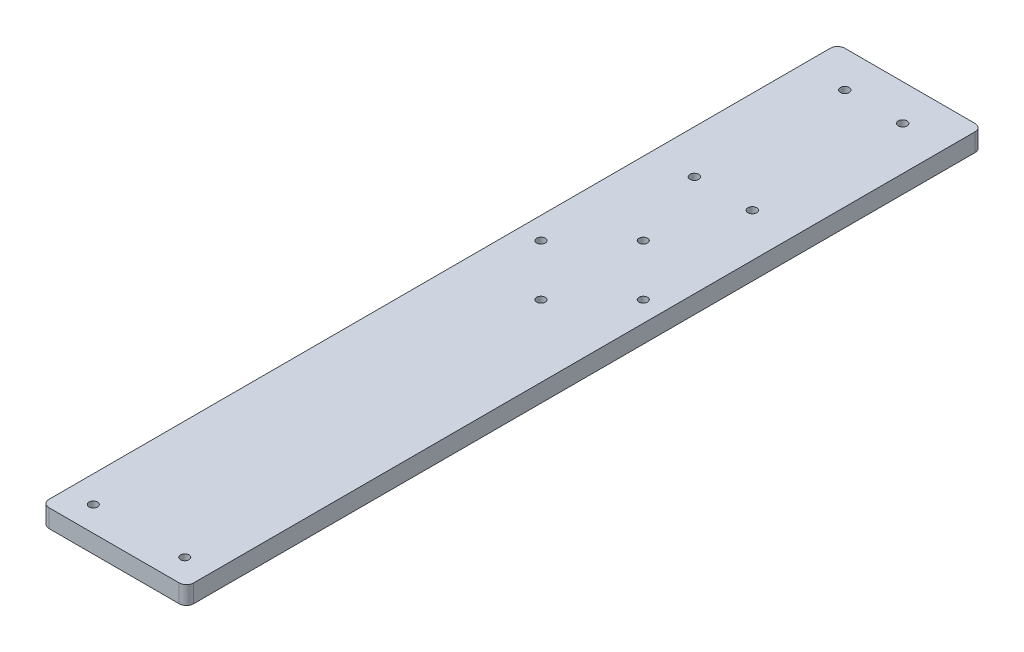
ISO-10303-21;
HEADER;
FILE_DESCRIPTION(('STEP AP214'),'2;1');
FILE_NAME('part.step','',(''),(''),'','','');
FILE_SCHEMA(('AUTOMOTIVE_DESIGN { 1 0 10303 214 1 1 1 1 }'));
ENDSEC;
DATA;
#1=APPLICATION_CONTEXT('core data for automotive mechanical design processes');
#2=APPLICATION_PROTOCOL_DEFINITION('international standard','automotive_design',2000,#1);
#3=PRODUCT_CONTEXT('',#1,'mechanical');
#4=PRODUCT('Part','Part','',(#3));
#5=PRODUCT_RELATED_PRODUCT_CATEGORY('part','',(#4));
#6=PRODUCT_DEFINITION_FORMATION('','',#4);
#7=PRODUCT_DEFINITION_CONTEXT('part definition',#1,'design');
#8=PRODUCT_DEFINITION('design','',#6,#7);
#9=PRODUCT_DEFINITION_SHAPE('','',#8);
#10=(LENGTH_UNIT() NAMED_UNIT(*) SI_UNIT(.MILLI.,.METRE.));
#11=(NAMED_UNIT(*) PLANE_ANGLE_UNIT() SI_UNIT($,.RADIAN.));
#12=(NAMED_UNIT(*) SI_UNIT($,.STERADIAN.) SOLID_ANGLE_UNIT());
#13=UNCERTAINTY_MEASURE_WITH_UNIT(LENGTH_MEASURE(1.E-05),#10,'distance_accuracy_value','');
#14=(GEOMETRIC_REPRESENTATION_CONTEXT(3) GLOBAL_UNCERTAINTY_ASSIGNED_CONTEXT((#13)) GLOBAL_UNIT_ASSIGNED_CONTEXT((#10,
#11,#12)) REPRESENTATION_CONTEXT('',''));
#15=CARTESIAN_POINT('',(0.,0.,0.));
#16=DIRECTION('',(0.,0.,1.));
#17=DIRECTION('',(1.,0.,0.));
#18=AXIS2_PLACEMENT_3D('',#15,#16,#17);
#19=CARTESIAN_POINT('',(2.54,6.35,-2.54));
#20=DIRECTION('',(0.,-1.,0.));
#21=DIRECTION('',(0.,0.,-1.));
#22=AXIS2_PLACEMENT_3D('',#19,#20,#21);
#23=CYLINDRICAL_SURFACE('',#22,2.54);
#24=CARTESIAN_POINT('',(2.54,0.,-2.54));
#25=DIRECTION('',(0.,1.,0.));
#26=DIRECTION('',(0.,0.,-1.));
#27=AXIS2_PLACEMENT_3D('',#24,#25,#26);
#28=CIRCLE('',#27,2.54);
#29=CARTESIAN_POINT('',(0.,0.,-2.54000000000002));
#30=VERTEX_POINT('',#29);
#31=CARTESIAN_POINT('',(2.54000000000002,0.,0.));
#32=VERTEX_POINT('',#31);
#33=EDGE_CURVE('E137',#30,#32,#28,.T.);
#34=ORIENTED_EDGE('',*,*,#33,.T.);
#35=DIRECTION('',(0.,-1.,0.));
#36=VECTOR('',#35,1.);
#37=CARTESIAN_POINT('',(2.54000000000002,6.35,0.));
#38=LINE('',#37,#36);
#39=CARTESIAN_POINT('',(2.54000000000002,6.35,0.));
#40=VERTEX_POINT('',#39);
#41=EDGE_CURVE('E11',#40,#32,#38,.T.);
#42=ORIENTED_EDGE('',*,*,#41,.F.);
#43=CARTESIAN_POINT('',(2.54,6.35,-2.54));
#44=DIRECTION('',(0.,1.,0.));
#45=DIRECTION('',(0.,0.,-1.));
#46=AXIS2_PLACEMENT_3D('',#43,#44,#45);
#47=CIRCLE('',#46,2.54);
#48=CARTESIAN_POINT('',(0.,6.35,-2.54000000000002));
#49=VERTEX_POINT('',#48);
#50=EDGE_CURVE('E159',#49,#40,#47,.T.);
#51=ORIENTED_EDGE('',*,*,#50,.F.);
#52=DIRECTION('',(0.,-1.,0.));
#53=VECTOR('',#52,1.);
#54=CARTESIAN_POINT('',(0.,6.35,-2.54000000000002));
#55=LINE('',#54,#53);
#56=EDGE_CURVE('E133',#49,#30,#55,.T.);
#57=ORIENTED_EDGE('',*,*,#56,.T.);
#58=EDGE_LOOP('',(#34,#42,#51,#57));
#59=FACE_BOUND('',#58,.T.);
#60=ADVANCED_FACE('F34',(#59),#23,.T.);
#61=CARTESIAN_POINT('',(2.54000000000002,6.35,0.));
#62=DIRECTION('',(0.,0.,-1.));
#63=DIRECTION('',(-1.,0.,0.));
#64=AXIS2_PLACEMENT_3D('',#61,#62,#63);
#65=PLANE('',#64);
#66=DIRECTION('',(1.,0.,0.));
#67=VECTOR('',#66,1.);
#68=CARTESIAN_POINT('',(2.54000000000002,0.,0.));
#69=LINE('',#68,#67);
#70=CARTESIAN_POINT('',(48.26,0.,0.));
#71=VERTEX_POINT('',#70);
#72=EDGE_CURVE('E141',#32,#71,#69,.T.);
#73=ORIENTED_EDGE('',*,*,#72,.T.);
#74=DIRECTION('',(0.,-1.,0.));
#75=VECTOR('',#74,1.);
#76=CARTESIAN_POINT('',(48.26,6.35,0.));
#77=LINE('',#76,#75);
#78=CARTESIAN_POINT('',(48.26,6.35,0.));
#79=VERTEX_POINT('',#78);
#80=EDGE_CURVE('E43',#79,#71,#77,.T.);
#81=ORIENTED_EDGE('',*,*,#80,.F.);
#82=DIRECTION('',(1.,0.,0.));
#83=VECTOR('',#82,1.);
#84=CARTESIAN_POINT('',(2.54000000000002,6.35,0.));
#85=LINE('',#84,#83);
#86=EDGE_CURVE('E94',#40,#79,#85,.T.);
#87=ORIENTED_EDGE('',*,*,#86,.F.);
#88=ORIENTED_EDGE('',*,*,#41,.T.);
#89=EDGE_LOOP('',(#73,#81,#87,#88));
#90=FACE_BOUND('',#89,.T.);
#91=ADVANCED_FACE('F326',(#90),#65,.F.);
#92=CARTESIAN_POINT('',(48.26,6.35,-2.54));
#93=DIRECTION('',(0.,-1.,0.));
#94=DIRECTION('',(0.,0.,-1.));
#95=AXIS2_PLACEMENT_3D('',#92,#93,#94);
#96=CYLINDRICAL_SURFACE('',#95,2.54);
#97=CARTESIAN_POINT('',(48.26,0.,-2.54));
#98=DIRECTION('',(0.,1.,0.));
#99=DIRECTION('',(0.,0.,1.));
#100=AXIS2_PLACEMENT_3D('',#97,#98,#99);
#101=CIRCLE('',#100,2.54);
#102=CARTESIAN_POINT('',(50.8,0.,-2.54000000000002));
#103=VERTEX_POINT('',#102);
#104=EDGE_CURVE('E145',#71,#103,#101,.T.);
#105=ORIENTED_EDGE('',*,*,#104,.T.);
#106=DIRECTION('',(0.,-1.,0.));
#107=VECTOR('',#106,1.);
#108=CARTESIAN_POINT('',(50.8,6.35,-2.54000000000002));
#109=LINE('',#108,#107);
#110=CARTESIAN_POINT('',(50.8,6.35,-2.54000000000002));
#111=VERTEX_POINT('',#110);
#112=EDGE_CURVE('E170',#111,#103,#109,.T.);
#113=ORIENTED_EDGE('',*,*,#112,.F.);
#114=CARTESIAN_POINT('',(48.26,6.35,-2.54));
#115=DIRECTION('',(0.,1.,0.));
#116=DIRECTION('',(0.,0.,1.));
#117=AXIS2_PLACEMENT_3D('',#114,#115,#116);
#118=CIRCLE('',#117,2.54);
#119=EDGE_CURVE('E182',#79,#111,#118,.T.);
#120=ORIENTED_EDGE('',*,*,#119,.F.);
#121=ORIENTED_EDGE('',*,*,#80,.T.);
#122=EDGE_LOOP('',(#105,#113,#120,#121));
#123=FACE_BOUND('',#122,.T.);
#124=ADVANCED_FACE('F180',(#123),#96,.T.);
#125=CARTESIAN_POINT('',(50.8,6.35,-2.54000000000002));
#126=DIRECTION('',(-1.,0.,0.));
#127=DIRECTION('',(0.,0.,1.));
#128=AXIS2_PLACEMENT_3D('',#125,#126,#127);
#129=PLANE('',#128);
#130=DIRECTION('',(0.,0.,-1.));
#131=VECTOR('',#130,1.);
#132=CARTESIAN_POINT('',(50.8,0.,-2.54000000000002));
#133=LINE('',#132,#131);
#134=CARTESIAN_POINT('',(50.8,0.,-276.86));
#135=VERTEX_POINT('',#134);
#136=EDGE_CURVE('E148',#103,#135,#133,.T.);
#137=ORIENTED_EDGE('',*,*,#136,.T.);
#138=DIRECTION('',(0.,-1.,0.));
#139=VECTOR('',#138,1.);
#140=CARTESIAN_POINT('',(50.8,6.35,-276.86));
#141=LINE('',#140,#139);
#142=CARTESIAN_POINT('',(50.8,6.35,-276.86));
#143=VERTEX_POINT('',#142);
#144=EDGE_CURVE('E166',#143,#135,#141,.T.);
#145=ORIENTED_EDGE('',*,*,#144,.F.);
#146=DIRECTION('',(0.,0.,-1.));
#147=VECTOR('',#146,1.);
#148=CARTESIAN_POINT('',(50.8,6.35,-2.54000000000002));
#149=LINE('',#148,#147);
#150=EDGE_CURVE('E195',#111,#143,#149,.T.);
#151=ORIENTED_EDGE('',*,*,#150,.F.);
#152=ORIENTED_EDGE('',*,*,#112,.T.);
#153=EDGE_LOOP('',(#137,#145,#151,#152));
#154=FACE_BOUND('',#153,.T.);
#155=ADVANCED_FACE('F190',(#154),#129,.F.);
#156=CARTESIAN_POINT('',(48.26,6.35,-276.86));
#157=DIRECTION('',(0.,-1.,0.));
#158=DIRECTION('',(0.,0.,-1.));
#159=AXIS2_PLACEMENT_3D('',#156,#157,#158);
#160=CYLINDRICAL_SURFACE('',#159,2.53999999999999);
#161=CARTESIAN_POINT('',(48.26,0.,-276.86));
#162=DIRECTION('',(0.,1.,0.));
#163=DIRECTION('',(0.,0.,-1.));
#164=AXIS2_PLACEMENT_3D('',#161,#162,#163);
#165=CIRCLE('',#164,2.53999999999999);
#166=CARTESIAN_POINT('',(48.26,0.,-279.4));
#167=VERTEX_POINT('',#166);
#168=EDGE_CURVE('E151',#135,#167,#165,.T.);
#169=ORIENTED_EDGE('',*,*,#168,.T.);
#170=DIRECTION('',(0.,-1.,0.));
#171=VECTOR('',#170,1.);
#172=CARTESIAN_POINT('',(48.26,6.35,-279.4));
#173=LINE('',#172,#171);
#174=CARTESIAN_POINT('',(48.26,6.35,-279.4));
#175=VERTEX_POINT('',#174);
#176=EDGE_CURVE('E124',#175,#167,#173,.T.);
#177=ORIENTED_EDGE('',*,*,#176,.F.);
#178=CARTESIAN_POINT('',(48.26,6.35,-276.86));
#179=DIRECTION('',(0.,1.,0.));
#180=DIRECTION('',(0.,0.,-1.));
#181=AXIS2_PLACEMENT_3D('',#178,#179,#180);
#182=CIRCLE('',#181,2.53999999999999);
#183=EDGE_CURVE('E113',#143,#175,#182,.T.);
#184=ORIENTED_EDGE('',*,*,#183,.F.);
#185=ORIENTED_EDGE('',*,*,#144,.T.);
#186=EDGE_LOOP('',(#169,#177,#184,#185));
#187=FACE_BOUND('',#186,.T.);
#188=ADVANCED_FACE('F193',(#187),#160,.T.);
#189=CARTESIAN_POINT('',(2.54,6.35,-279.4));
#190=DIRECTION('',(0.,0.,1.));
#191=DIRECTION('',(1.,0.,0.));
#192=AXIS2_PLACEMENT_3D('',#189,#190,#191);
#193=PLANE('',#192);
#194=DIRECTION('',(-1.,0.,0.));
#195=VECTOR('',#194,1.);
#196=CARTESIAN_POINT('',(2.54,0.,-279.4));
#197=LINE('',#196,#195);
#198=CARTESIAN_POINT('',(2.54,0.,-279.4));
#199=VERTEX_POINT('',#198);
#200=EDGE_CURVE('E122',#167,#199,#197,.T.);
#201=ORIENTED_EDGE('',*,*,#200,.T.);
#202=DIRECTION('',(0.,-1.,0.));
#203=VECTOR('',#202,1.);
#204=CARTESIAN_POINT('',(2.54,6.35,-279.4));
#205=LINE('',#204,#203);
#206=CARTESIAN_POINT('',(2.54,6.35,-279.4));
#207=VERTEX_POINT('',#206);
#208=EDGE_CURVE('E119',#207,#199,#205,.T.);
#209=ORIENTED_EDGE('',*,*,#208,.F.);
#210=DIRECTION('',(-1.,0.,0.));
#211=VECTOR('',#210,1.);
#212=CARTESIAN_POINT('',(2.54,6.35,-279.4));
#213=LINE('',#212,#211);
#214=EDGE_CURVE('E107',#175,#207,#213,.T.);
#215=ORIENTED_EDGE('',*,*,#214,.F.);
#216=ORIENTED_EDGE('',*,*,#176,.T.);
#217=EDGE_LOOP('',(#201,#209,#215,#216));
#218=FACE_BOUND('',#217,.T.);
#219=ADVANCED_FACE('F120',(#218),#193,.F.);
#220=CARTESIAN_POINT('',(2.54,6.35,-276.86));
#221=DIRECTION('',(0.,-1.,0.));
#222=DIRECTION('',(0.,0.,-1.));
#223=AXIS2_PLACEMENT_3D('',#220,#221,#222);
#224=CYLINDRICAL_SURFACE('',#223,2.53999999999999);
#225=CARTESIAN_POINT('',(2.54,0.,-276.86));
#226=DIRECTION('',(0.,1.,0.));
#227=DIRECTION('',(0.,0.,-1.));
#228=AXIS2_PLACEMENT_3D('',#225,#226,#227);
#229=CIRCLE('',#228,2.53999999999999);
#230=CARTESIAN_POINT('',(0.,0.,-276.86));
#231=VERTEX_POINT('',#230);
#232=EDGE_CURVE('E80',#199,#231,#229,.T.);
#233=ORIENTED_EDGE('',*,*,#232,.T.);
#234=DIRECTION('',(0.,-1.,0.));
#235=VECTOR('',#234,1.);
#236=CARTESIAN_POINT('',(0.,6.35,-276.86));
#237=LINE('',#236,#235);
#238=CARTESIAN_POINT('',(0.,6.35,-276.86));
#239=VERTEX_POINT('',#238);
#240=EDGE_CURVE('E125',#239,#231,#237,.T.);
#241=ORIENTED_EDGE('',*,*,#240,.F.);
#242=CARTESIAN_POINT('',(2.54,6.35,-276.86));
#243=DIRECTION('',(0.,1.,0.));
#244=DIRECTION('',(0.,0.,-1.));
#245=AXIS2_PLACEMENT_3D('',#242,#243,#244);
#246=CIRCLE('',#245,2.53999999999999);
#247=EDGE_CURVE('E111',#207,#239,#246,.T.);
#248=ORIENTED_EDGE('',*,*,#247,.F.);
#249=ORIENTED_EDGE('',*,*,#208,.T.);
#250=EDGE_LOOP('',(#233,#241,#248,#249));
#251=FACE_BOUND('',#250,.T.);
#252=ADVANCED_FACE('F127',(#251),#224,.T.);
#253=CARTESIAN_POINT('',(0.,6.35,-2.54000000000002));
#254=DIRECTION('',(1.,0.,0.));
#255=DIRECTION('',(0.,0.,-1.));
#256=AXIS2_PLACEMENT_3D('',#253,#254,#255);
#257=PLANE('',#256);
#258=DIRECTION('',(0.,0.,1.));
#259=VECTOR('',#258,1.);
#260=CARTESIAN_POINT('',(0.,0.,-2.54000000000002));
#261=LINE('',#260,#259);
#262=EDGE_CURVE('E86',#231,#30,#261,.T.);
#263=ORIENTED_EDGE('',*,*,#262,.T.);
#264=ORIENTED_EDGE('',*,*,#56,.F.);
#265=DIRECTION('',(0.,0.,1.));
#266=VECTOR('',#265,1.);
#267=CARTESIAN_POINT('',(0.,6.35,-2.54000000000002));
#268=LINE('',#267,#266);
#269=EDGE_CURVE('E51',#239,#49,#268,.T.);
#270=ORIENTED_EDGE('',*,*,#269,.F.);
#271=ORIENTED_EDGE('',*,*,#240,.T.);
#272=EDGE_LOOP('',(#263,#264,#270,#271));
#273=FACE_BOUND('',#272,.T.);
#274=ADVANCED_FACE('F333',(#273),#257,.F.);
#275=CARTESIAN_POINT('',(2.54,6.35,-2.54));
#276=DIRECTION('',(0.,-1.,0.));
#277=DIRECTION('',(0.,0.,-1.));
#278=AXIS2_PLACEMENT_3D('',#275,#276,#277);
#279=PLANE('',#278);
#280=CARTESIAN_POINT('',(35.56,6.35,-213.899999999999));
#281=DIRECTION('',(0.,-1.,0.));
#282=DIRECTION('',(0.,0.,-1.));
#283=AXIS2_PLACEMENT_3D('',#280,#281,#282);
#284=CIRCLE('',#283,1.54999999999999);
#285=CARTESIAN_POINT('',(35.56,6.35,-215.449999999999));
#286=VERTEX_POINT('',#285);
#287=EDGE_CURVE('E270',#286,#286,#284,.T.);
#288=ORIENTED_EDGE('',*,*,#287,.T.);
#289=EDGE_LOOP('',(#288));
#290=FACE_BOUND('',#289,.T.);
#291=CARTESIAN_POINT('',(15.24,6.35,-213.899999999999));
#292=DIRECTION('',(0.,-1.,0.));
#293=DIRECTION('',(0.,0.,-1.));
#294=AXIS2_PLACEMENT_3D('',#291,#292,#293);
#295=CIRCLE('',#294,1.55);
#296=CARTESIAN_POINT('',(15.24,6.35,-215.449999999999));
#297=VERTEX_POINT('',#296);
#298=EDGE_CURVE('E263',#297,#297,#295,.T.);
#299=ORIENTED_EDGE('',*,*,#298,.T.);
#300=EDGE_LOOP('',(#299));
#301=FACE_BOUND('',#300,.T.);
#302=CARTESIAN_POINT('',(35.56,6.35,-266.7));
#303=DIRECTION('',(0.,-1.,0.));
#304=DIRECTION('',(0.,0.,-1.));
#305=AXIS2_PLACEMENT_3D('',#302,#303,#304);
#306=CIRCLE('',#305,1.55000000000001);
#307=CARTESIAN_POINT('',(35.56,6.35,-268.25));
#308=VERTEX_POINT('',#307);
#309=EDGE_CURVE('E256',#308,#308,#306,.T.);
#310=ORIENTED_EDGE('',*,*,#309,.T.);
#311=EDGE_LOOP('',(#310));
#312=FACE_BOUND('',#311,.T.);
#313=CARTESIAN_POINT('',(15.24,6.35,-266.7));
#314=DIRECTION('',(0.,-1.,0.));
#315=DIRECTION('',(0.,0.,-1.));
#316=AXIS2_PLACEMENT_3D('',#313,#314,#315);
#317=CIRCLE('',#316,1.55000000000001);
#318=CARTESIAN_POINT('',(15.24,6.35,-268.25));
#319=VERTEX_POINT('',#318);
#320=EDGE_CURVE('E248',#319,#319,#317,.T.);
#321=ORIENTED_EDGE('',*,*,#320,.T.);
#322=EDGE_LOOP('',(#321));
#323=FACE_BOUND('',#322,.T.);
#324=CARTESIAN_POINT('',(9.34999999999999,6.35,-8.75848719394659));
#325=DIRECTION('',(0.,-1.,0.));
#326=DIRECTION('',(0.,0.,-1.));
#327=AXIS2_PLACEMENT_3D('',#324,#325,#326);
#328=CIRCLE('',#327,1.5);
#329=CARTESIAN_POINT('',(9.34999999999999,6.35,-10.2584871939466));
#330=VERTEX_POINT('',#329);
#331=EDGE_CURVE('E240',#330,#330,#328,.T.);
#332=ORIENTED_EDGE('',*,*,#331,.T.);
#333=EDGE_LOOP('',(#332));
#334=FACE_BOUND('',#333,.T.);
#335=CARTESIAN_POINT('',(41.45,6.35,-8.75848719394656));
#336=DIRECTION('',(0.,-1.,0.));
#337=DIRECTION('',(0.,0.,-1.));
#338=AXIS2_PLACEMENT_3D('',#335,#336,#337);
#339=CIRCLE('',#338,1.5);
#340=CARTESIAN_POINT('',(41.45,6.35,-10.2584871939466));
#341=VERTEX_POINT('',#340);
#342=EDGE_CURVE('E232',#341,#341,#339,.T.);
#343=ORIENTED_EDGE('',*,*,#342,.T.);
#344=EDGE_LOOP('',(#343));
#345=FACE_BOUND('',#344,.T.);
#346=CARTESIAN_POINT('',(25.6620879768943,6.35,-149.60397551572));
#347=DIRECTION('',(0.,-1.,0.));
#348=DIRECTION('',(0.,0.,-1.));
#349=AXIS2_PLACEMENT_3D('',#346,#347,#348);
#350=CIRCLE('',#349,1.5);
#351=CARTESIAN_POINT('',(25.6620879768943,6.35,-151.10397551572));
#352=VERTEX_POINT('',#351);
#353=EDGE_CURVE('E224',#352,#352,#350,.T.);
#354=ORIENTED_EDGE('',*,*,#353,.T.);
#355=EDGE_LOOP('',(#354));
#356=FACE_BOUND('',#355,.T.);
#357=CARTESIAN_POINT('',(7.70157573475598,6.35,-167.564487757859));
#358=DIRECTION('',(0.,-1.,0.));
#359=DIRECTION('',(0.,0.,-1.));
#360=AXIS2_PLACEMENT_3D('',#357,#358,#359);
#361=CIRCLE('',#360,1.5);
#362=CARTESIAN_POINT('',(7.70157573475598,6.35,-169.064487757859));
#363=VERTEX_POINT('',#362);
#364=EDGE_CURVE('E217',#363,#363,#361,.T.);
#365=ORIENTED_EDGE('',*,*,#364,.T.);
#366=EDGE_LOOP('',(#365));
#367=FACE_BOUND('',#366,.T.);
#368=CARTESIAN_POINT('',(43.6226002190326,6.35,-167.564487757859));
#369=DIRECTION('',(0.,-1.,0.));
#370=DIRECTION('',(0.,0.,-1.));
#371=AXIS2_PLACEMENT_3D('',#368,#369,#370);
#372=CIRCLE('',#371,1.5);
#373=CARTESIAN_POINT('',(43.6226002190326,6.35,-169.064487757859));
#374=VERTEX_POINT('',#373);
#375=EDGE_CURVE('E209',#374,#374,#372,.T.);
#376=ORIENTED_EDGE('',*,*,#375,.T.);
#377=EDGE_LOOP('',(#376));
#378=FACE_BOUND('',#377,.T.);
#379=CARTESIAN_POINT('',(25.6620879768943,6.35,-185.524999999997));
#380=DIRECTION('',(0.,-1.,0.));
#381=DIRECTION('',(0.,0.,-1.));
#382=AXIS2_PLACEMENT_3D('',#379,#380,#381);
#383=CIRCLE('',#382,1.5);
#384=CARTESIAN_POINT('',(25.6620879768943,6.35,-187.024999999997));
#385=VERTEX_POINT('',#384);
#386=EDGE_CURVE('E142',#385,#385,#383,.T.);
#387=ORIENTED_EDGE('',*,*,#386,.T.);
#388=EDGE_LOOP('',(#387));
#389=FACE_BOUND('',#388,.T.);
#390=ORIENTED_EDGE('',*,*,#50,.T.);
#391=ORIENTED_EDGE('',*,*,#86,.T.);
#392=ORIENTED_EDGE('',*,*,#119,.T.);
#393=ORIENTED_EDGE('',*,*,#150,.T.);
#394=ORIENTED_EDGE('',*,*,#183,.T.);
#395=ORIENTED_EDGE('',*,*,#214,.T.);
#396=ORIENTED_EDGE('',*,*,#247,.T.);
#397=ORIENTED_EDGE('',*,*,#269,.T.);
#398=EDGE_LOOP('',(#390,#391,#392,#393,#394,#395,#396,#397));
#399=FACE_BOUND('',#398,.T.);
#400=ADVANCED_FACE('F109',(#290,#301,#312,#323,#334,#345,#356,#367,#378,#389,#399),#279,.F.);
#401=CARTESIAN_POINT('',(2.54,0.,-2.54));
#402=DIRECTION('',(0.,-1.,0.));
#403=DIRECTION('',(0.,0.,-1.));
#404=AXIS2_PLACEMENT_3D('',#401,#402,#403);
#405=PLANE('',#404);
#406=CARTESIAN_POINT('',(35.56,0.,-213.899999999999));
#407=DIRECTION('',(0.,-1.,0.));
#408=DIRECTION('',(0.,0.,-1.));
#409=AXIS2_PLACEMENT_3D('',#406,#407,#408);
#410=CIRCLE('',#409,1.54999999999999);
#411=CARTESIAN_POINT('',(35.56,0.,-215.449999999999));
#412=VERTEX_POINT('',#411);
#413=EDGE_CURVE('E274',#412,#412,#410,.T.);
#414=ORIENTED_EDGE('',*,*,#413,.F.);
#415=EDGE_LOOP('',(#414));
#416=FACE_BOUND('',#415,.T.);
#417=CARTESIAN_POINT('',(15.24,0.,-213.899999999999));
#418=DIRECTION('',(0.,-1.,0.));
#419=DIRECTION('',(0.,0.,-1.));
#420=AXIS2_PLACEMENT_3D('',#417,#418,#419);
#421=CIRCLE('',#420,1.55);
#422=CARTESIAN_POINT('',(15.24,0.,-215.449999999999));
#423=VERTEX_POINT('',#422);
#424=EDGE_CURVE('E266',#423,#423,#421,.T.);
#425=ORIENTED_EDGE('',*,*,#424,.F.);
#426=EDGE_LOOP('',(#425));
#427=FACE_BOUND('',#426,.T.);
#428=CARTESIAN_POINT('',(35.56,0.,-266.7));
#429=DIRECTION('',(0.,-1.,0.));
#430=DIRECTION('',(0.,0.,-1.));
#431=AXIS2_PLACEMENT_3D('',#428,#429,#430);
#432=CIRCLE('',#431,1.55000000000001);
#433=CARTESIAN_POINT('',(35.56,0.,-268.25));
#434=VERTEX_POINT('',#433);
#435=EDGE_CURVE('E260',#434,#434,#432,.T.);
#436=ORIENTED_EDGE('',*,*,#435,.F.);
#437=EDGE_LOOP('',(#436));
#438=FACE_BOUND('',#437,.T.);
#439=CARTESIAN_POINT('',(15.24,0.,-266.7));
#440=DIRECTION('',(0.,-1.,0.));
#441=DIRECTION('',(0.,0.,-1.));
#442=AXIS2_PLACEMENT_3D('',#439,#440,#441);
#443=CIRCLE('',#442,1.55000000000001);
#444=CARTESIAN_POINT('',(15.24,0.,-268.25));
#445=VERTEX_POINT('',#444);
#446=EDGE_CURVE('E252',#445,#445,#443,.T.);
#447=ORIENTED_EDGE('',*,*,#446,.F.);
#448=EDGE_LOOP('',(#447));
#449=FACE_BOUND('',#448,.T.);
#450=CARTESIAN_POINT('',(9.34999999999999,0.,-8.75848719394659));
#451=DIRECTION('',(0.,-1.,0.));
#452=DIRECTION('',(0.,0.,-1.));
#453=AXIS2_PLACEMENT_3D('',#450,#451,#452);
#454=CIRCLE('',#453,1.5);
#455=CARTESIAN_POINT('',(9.34999999999999,0.,-10.2584871939466));
#456=VERTEX_POINT('',#455);
#457=EDGE_CURVE('E244',#456,#456,#454,.T.);
#458=ORIENTED_EDGE('',*,*,#457,.F.);
#459=EDGE_LOOP('',(#458));
#460=FACE_BOUND('',#459,.T.);
#461=CARTESIAN_POINT('',(41.45,0.,-8.75848719394656));
#462=DIRECTION('',(0.,-1.,0.));
#463=DIRECTION('',(0.,0.,-1.));
#464=AXIS2_PLACEMENT_3D('',#461,#462,#463);
#465=CIRCLE('',#464,1.5);
#466=CARTESIAN_POINT('',(41.45,0.,-10.2584871939466));
#467=VERTEX_POINT('',#466);
#468=EDGE_CURVE('E236',#467,#467,#465,.T.);
#469=ORIENTED_EDGE('',*,*,#468,.F.);
#470=EDGE_LOOP('',(#469));
#471=FACE_BOUND('',#470,.T.);
#472=CARTESIAN_POINT('',(25.6620879768943,0.,-149.60397551572));
#473=DIRECTION('',(0.,-1.,0.));
#474=DIRECTION('',(0.,0.,-1.));
#475=AXIS2_PLACEMENT_3D('',#472,#473,#474);
#476=CIRCLE('',#475,1.5);
#477=CARTESIAN_POINT('',(25.6620879768943,0.,-151.10397551572));
#478=VERTEX_POINT('',#477);
#479=EDGE_CURVE('E228',#478,#478,#476,.T.);
#480=ORIENTED_EDGE('',*,*,#479,.F.);
#481=EDGE_LOOP('',(#480));
#482=FACE_BOUND('',#481,.T.);
#483=CARTESIAN_POINT('',(7.70157573475598,0.,-167.564487757859));
#484=DIRECTION('',(0.,-1.,0.));
#485=DIRECTION('',(0.,0.,-1.));
#486=AXIS2_PLACEMENT_3D('',#483,#484,#485);
#487=CIRCLE('',#486,1.5);
#488=CARTESIAN_POINT('',(7.70157573475598,0.,-169.064487757859));
#489=VERTEX_POINT('',#488);
#490=EDGE_CURVE('E221',#489,#489,#487,.T.);
#491=ORIENTED_EDGE('',*,*,#490,.F.);
#492=EDGE_LOOP('',(#491));
#493=FACE_BOUND('',#492,.T.);
#494=CARTESIAN_POINT('',(43.6226002190326,0.,-167.564487757859));
#495=DIRECTION('',(0.,-1.,0.));
#496=DIRECTION('',(0.,0.,-1.));
#497=AXIS2_PLACEMENT_3D('',#494,#495,#496);
#498=CIRCLE('',#497,1.5);
#499=CARTESIAN_POINT('',(43.6226002190326,0.,-169.064487757859));
#500=VERTEX_POINT('',#499);
#501=EDGE_CURVE('E213',#500,#500,#498,.T.);
#502=ORIENTED_EDGE('',*,*,#501,.F.);
#503=EDGE_LOOP('',(#502));
#504=FACE_BOUND('',#503,.T.);
#505=CARTESIAN_POINT('',(25.6620879768943,0.,-185.524999999997));
#506=DIRECTION('',(0.,-1.,0.));
#507=DIRECTION('',(0.,0.,-1.));
#508=AXIS2_PLACEMENT_3D('',#505,#506,#507);
#509=CIRCLE('',#508,1.5);
#510=CARTESIAN_POINT('',(25.6620879768943,0.,-187.024999999997));
#511=VERTEX_POINT('',#510);
#512=EDGE_CURVE('E205',#511,#511,#509,.T.);
#513=ORIENTED_EDGE('',*,*,#512,.F.);
#514=EDGE_LOOP('',(#513));
#515=FACE_BOUND('',#514,.T.);
#516=ORIENTED_EDGE('',*,*,#33,.F.);
#517=ORIENTED_EDGE('',*,*,#262,.F.);
#518=ORIENTED_EDGE('',*,*,#232,.F.);
#519=ORIENTED_EDGE('',*,*,#200,.F.);
#520=ORIENTED_EDGE('',*,*,#168,.F.);
#521=ORIENTED_EDGE('',*,*,#136,.F.);
#522=ORIENTED_EDGE('',*,*,#104,.F.);
#523=ORIENTED_EDGE('',*,*,#72,.F.);
#524=EDGE_LOOP('',(#516,#517,#518,#519,#520,#521,#522,#523));
#525=FACE_BOUND('',#524,.T.);
#526=ADVANCED_FACE('F186',(#416,#427,#438,#449,#460,#471,#482,#493,#504,#515,#525),#405,.T.);
#527=CARTESIAN_POINT('',(25.6620879768943,6.35,-185.524999999997));
#528=DIRECTION('',(0.,-1.,0.));
#529=DIRECTION('',(0.,0.,-1.));
#530=AXIS2_PLACEMENT_3D('',#527,#528,#529);
#531=CYLINDRICAL_SURFACE('',#530,1.5);
#532=ORIENTED_EDGE('',*,*,#386,.F.);
#533=EDGE_LOOP('',(#532));
#534=FACE_BOUND('',#533,.T.);
#535=ORIENTED_EDGE('',*,*,#512,.T.);
#536=EDGE_LOOP('',(#535));
#537=FACE_BOUND('',#536,.T.);
#538=ADVANCED_FACE('F293',(#534,#537),#531,.F.);
#539=CARTESIAN_POINT('',(43.6226002190326,6.35,-167.564487757859));
#540=DIRECTION('',(0.,-1.,0.));
#541=DIRECTION('',(0.,0.,-1.));
#542=AXIS2_PLACEMENT_3D('',#539,#540,#541);
#543=CYLINDRICAL_SURFACE('',#542,1.5);
#544=ORIENTED_EDGE('',*,*,#375,.F.);
#545=EDGE_LOOP('',(#544));
#546=FACE_BOUND('',#545,.T.);
#547=ORIENTED_EDGE('',*,*,#501,.T.);
#548=EDGE_LOOP('',(#547));
#549=FACE_BOUND('',#548,.T.);
#550=ADVANCED_FACE('F314',(#546,#549),#543,.F.);
#551=CARTESIAN_POINT('',(7.70157573475598,6.35,-167.564487757859));
#552=DIRECTION('',(0.,-1.,0.));
#553=DIRECTION('',(0.,0.,-1.));
#554=AXIS2_PLACEMENT_3D('',#551,#552,#553);
#555=CYLINDRICAL_SURFACE('',#554,1.5);
#556=ORIENTED_EDGE('',*,*,#364,.F.);
#557=EDGE_LOOP('',(#556));
#558=FACE_BOUND('',#557,.T.);
#559=ORIENTED_EDGE('',*,*,#490,.T.);
#560=EDGE_LOOP('',(#559));
#561=FACE_BOUND('',#560,.T.);
#562=ADVANCED_FACE('F320',(#558,#561),#555,.F.);
#563=CARTESIAN_POINT('',(25.6620879768943,6.35,-149.60397551572));
#564=DIRECTION('',(0.,-1.,0.));
#565=DIRECTION('',(0.,0.,-1.));
#566=AXIS2_PLACEMENT_3D('',#563,#564,#565);
#567=CYLINDRICAL_SURFACE('',#566,1.5);
#568=ORIENTED_EDGE('',*,*,#353,.F.);
#569=EDGE_LOOP('',(#568));
#570=FACE_BOUND('',#569,.T.);
#571=ORIENTED_EDGE('',*,*,#479,.T.);
#572=EDGE_LOOP('',(#571));
#573=FACE_BOUND('',#572,.T.);
#574=ADVANCED_FACE('F394',(#570,#573),#567,.F.);
#575=CARTESIAN_POINT('',(41.45,6.35,-8.75848719394656));
#576=DIRECTION('',(0.,-1.,0.));
#577=DIRECTION('',(0.,0.,-1.));
#578=AXIS2_PLACEMENT_3D('',#575,#576,#577);
#579=CYLINDRICAL_SURFACE('',#578,1.5);
#580=ORIENTED_EDGE('',*,*,#342,.F.);
#581=EDGE_LOOP('',(#580));
#582=FACE_BOUND('',#581,.T.);
#583=ORIENTED_EDGE('',*,*,#468,.T.);
#584=EDGE_LOOP('',(#583));
#585=FACE_BOUND('',#584,.T.);
#586=ADVANCED_FACE('F404',(#582,#585),#579,.F.);
#587=CARTESIAN_POINT('',(9.34999999999999,6.35,-8.75848719394659));
#588=DIRECTION('',(0.,-1.,0.));
#589=DIRECTION('',(0.,0.,-1.));
#590=AXIS2_PLACEMENT_3D('',#587,#588,#589);
#591=CYLINDRICAL_SURFACE('',#590,1.5);
#592=ORIENTED_EDGE('',*,*,#331,.F.);
#593=EDGE_LOOP('',(#592));
#594=FACE_BOUND('',#593,.T.);
#595=ORIENTED_EDGE('',*,*,#457,.T.);
#596=EDGE_LOOP('',(#595));
#597=FACE_BOUND('',#596,.T.);
#598=ADVANCED_FACE('F414',(#594,#597),#591,.F.);
#599=CARTESIAN_POINT('',(15.24,6.35,-266.7));
#600=DIRECTION('',(0.,-1.,0.));
#601=DIRECTION('',(0.,0.,-1.));
#602=AXIS2_PLACEMENT_3D('',#599,#600,#601);
#603=CYLINDRICAL_SURFACE('',#602,1.55000000000001);
#604=ORIENTED_EDGE('',*,*,#320,.F.);
#605=EDGE_LOOP('',(#604));
#606=FACE_BOUND('',#605,.T.);
#607=ORIENTED_EDGE('',*,*,#446,.T.);
#608=EDGE_LOOP('',(#607));
#609=FACE_BOUND('',#608,.T.);
#610=ADVANCED_FACE('F424',(#606,#609),#603,.F.);
#611=CARTESIAN_POINT('',(35.56,6.35,-266.7));
#612=DIRECTION('',(0.,-1.,0.));
#613=DIRECTION('',(0.,0.,-1.));
#614=AXIS2_PLACEMENT_3D('',#611,#612,#613);
#615=CYLINDRICAL_SURFACE('',#614,1.55000000000001);
#616=ORIENTED_EDGE('',*,*,#309,.F.);
#617=EDGE_LOOP('',(#616));
#618=FACE_BOUND('',#617,.T.);
#619=ORIENTED_EDGE('',*,*,#435,.T.);
#620=EDGE_LOOP('',(#619));
#621=FACE_BOUND('',#620,.T.);
#622=ADVANCED_FACE('F444',(#618,#621),#615,.F.);
#623=CARTESIAN_POINT('',(15.24,6.35,-213.899999999999));
#624=DIRECTION('',(0.,-1.,0.));
#625=DIRECTION('',(0.,0.,-1.));
#626=AXIS2_PLACEMENT_3D('',#623,#624,#625);
#627=CYLINDRICAL_SURFACE('',#626,1.55);
#628=ORIENTED_EDGE('',*,*,#298,.F.);
#629=EDGE_LOOP('',(#628));
#630=FACE_BOUND('',#629,.T.);
#631=ORIENTED_EDGE('',*,*,#424,.T.);
#632=EDGE_LOOP('',(#631));
#633=FACE_BOUND('',#632,.T.);
#634=ADVANCED_FACE('F287',(#630,#633),#627,.F.);
#635=CARTESIAN_POINT('',(35.56,6.35,-213.899999999999));
#636=DIRECTION('',(0.,-1.,0.));
#637=DIRECTION('',(0.,0.,-1.));
#638=AXIS2_PLACEMENT_3D('',#635,#636,#637);
#639=CYLINDRICAL_SURFACE('',#638,1.54999999999999);
#640=ORIENTED_EDGE('',*,*,#287,.F.);
#641=EDGE_LOOP('',(#640));
#642=FACE_BOUND('',#641,.T.);
#643=ORIENTED_EDGE('',*,*,#413,.T.);
#644=EDGE_LOOP('',(#643));
#645=FACE_BOUND('',#644,.T.);
#646=ADVANCED_FACE('F284',(#642,#645),#639,.F.);
#647=CLOSED_SHELL('',(#60,#91,#124,#155,#188,#219,#252,#274,#400,#526,#538,#550,#562,#574,#586,
#598,#610,#622,#634,#646));
#648=MANIFOLD_SOLID_BREP('B2',#647);
#649=ADVANCED_BREP_SHAPE_REPRESENTATION('',(#18,#648),#14);
#650=SHAPE_DEFINITION_REPRESENTATION(#9,#649);
ENDSEC;
END-ISO-10303-21;
